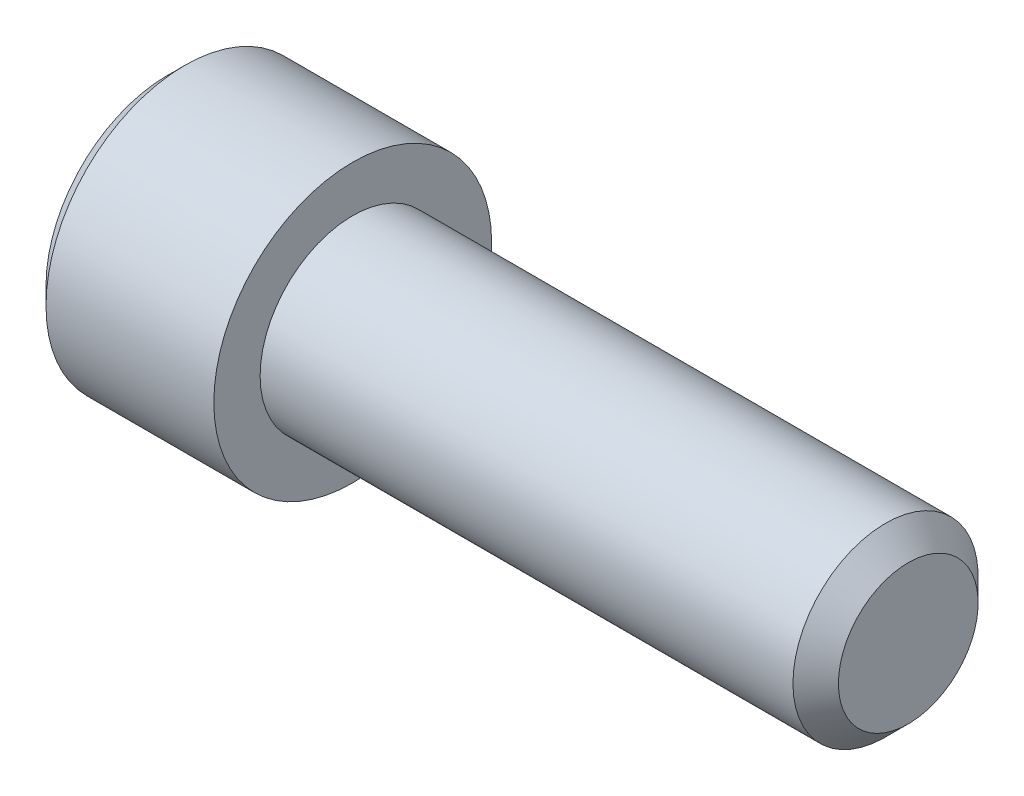
ISO-10303-21;
HEADER;
FILE_DESCRIPTION(('STEP AP214'),'2;1');
FILE_NAME('part.step','',(''),(''),'','','');
FILE_SCHEMA(('AUTOMOTIVE_DESIGN { 1 0 10303 214 1 1 1 1 }'));
ENDSEC;
DATA;
#1=APPLICATION_CONTEXT('core data for automotive mechanical design processes');
#2=APPLICATION_PROTOCOL_DEFINITION('international standard','automotive_design',2000,#1);
#3=PRODUCT_CONTEXT('',#1,'mechanical');
#4=PRODUCT('Part','Part','',(#3));
#5=PRODUCT_RELATED_PRODUCT_CATEGORY('part','',(#4));
#6=PRODUCT_DEFINITION_FORMATION('','',#4);
#7=PRODUCT_DEFINITION_CONTEXT('part definition',#1,'design');
#8=PRODUCT_DEFINITION('design','',#6,#7);
#9=PRODUCT_DEFINITION_SHAPE('','',#8);
#10=(LENGTH_UNIT() NAMED_UNIT(*) SI_UNIT(.MILLI.,.METRE.));
#11=(NAMED_UNIT(*) PLANE_ANGLE_UNIT() SI_UNIT($,.RADIAN.));
#12=(NAMED_UNIT(*) SI_UNIT($,.STERADIAN.) SOLID_ANGLE_UNIT());
#13=UNCERTAINTY_MEASURE_WITH_UNIT(LENGTH_MEASURE(1.E-05),#10,'distance_accuracy_value','');
#14=(GEOMETRIC_REPRESENTATION_CONTEXT(3) GLOBAL_UNCERTAINTY_ASSIGNED_CONTEXT((#13)) GLOBAL_UNIT_ASSIGNED_CONTEXT((#10,
#11,#12)) REPRESENTATION_CONTEXT('',''));
#15=CARTESIAN_POINT('',(0.,0.,0.));
#16=DIRECTION('',(0.,0.,1.));
#17=DIRECTION('',(1.,0.,0.));
#18=AXIS2_PLACEMENT_3D('',#15,#16,#17);
#19=CARTESIAN_POINT('',(-1.85,0.,0.));
#20=DIRECTION('',(-1.,0.,0.));
#21=DIRECTION('',(0.,0.,1.));
#22=AXIS2_PLACEMENT_3D('',#19,#20,#21);
#23=CONICAL_SURFACE('',#22,0.75,0.785398163397448);
#24=CARTESIAN_POINT('',(-2.,0.,0.));
#25=DIRECTION('',(-1.,0.,0.));
#26=DIRECTION('',(0.,0.,1.));
#27=AXIS2_PLACEMENT_3D('',#24,#25,#26);
#28=CIRCLE('',#27,0.9);
#29=CARTESIAN_POINT('',(-2.,0.,0.9));
#30=VERTEX_POINT('',#29);
#31=EDGE_CURVE('E226',#30,#30,#28,.T.);
#32=ORIENTED_EDGE('',*,*,#31,.T.);
#33=EDGE_LOOP('',(#32));
#34=FACE_BOUND('',#33,.T.);
#35=CARTESIAN_POINT('',(-1.96614089692921,0.866140873838278,-0.0002));
#36=CARTESIAN_POINT('',(-1.95125951424836,0.85125103201321,0.0255899625576815));
#37=CARTESIAN_POINT('',(-1.9372516693914,0.83611219228842,0.0518112021286592));
#38=CARTESIAN_POINT('',(-1.9116029284667,0.80524213589435,0.105279708235706));
#39=CARTESIAN_POINT('',(-1.89997631549011,0.789507978959821,0.132532067460573));
#40=CARTESIAN_POINT('',(-1.88005944955668,0.757780686272654,0.187485350381353));
#41=CARTESIAN_POINT('',(-1.87171909786581,0.741795643459148,0.21517225669551));
#42=CARTESIAN_POINT('',(-1.85886814574587,0.709473647943368,0.271155595130853));
#43=CARTESIAN_POINT('',(-1.85434794437328,0.693137683900543,0.299450314843645));
#44=CARTESIAN_POINT('',(-1.85027123688187,0.664986099540475,0.348210289268844));
#45=CARTESIAN_POINT('',(-1.84966820039852,0.653207128451651,0.368612065655573));
#46=CARTESIAN_POINT('',(-1.85067990979997,0.629671982217687,0.40937613469636));
#47=CARTESIAN_POINT('',(-1.85229514477447,0.617915812672248,0.429738417651455));
#48=CARTESIAN_POINT('',(-1.86036155075748,0.582815153286452,0.490534543086824));
#49=CARTESIAN_POINT('',(-1.87003433961216,0.559645329552699,0.530665854996099));
#50=CARTESIAN_POINT('',(-1.89338172175675,0.518974152327359,0.601110400354026));
#51=CARTESIAN_POINT('',(-1.90583396185669,0.501282308923486,0.631753572009086));
#52=CARTESIAN_POINT('',(-1.9338850140153,0.466591771248069,0.69183934580479));
#53=CARTESIAN_POINT('',(-1.94947358968819,0.449591032904757,0.721285488381591));
#54=CARTESIAN_POINT('',(-1.96614089692921,0.432897231838382,0.7502));
#55=B_SPLINE_CURVE_WITH_KNOTS('',3,(#35,#36,#37,#38,#39,#40,#41,#42,#43,#44,#45,#46,#47,#48,#49,
#50,#51,#52,#53,#54),.UNSPECIFIED.,.F.,.F.,(4,2,2,2,2,2,2,2,2,4),(0.,0.0999419466095598,
0.200466857654446,0.299393763705718,0.398071297300231,0.468665775681748,0.53927582139884,
0.680536257244566,0.792918418368074,0.904939568716032),.UNSPECIFIED.);
#56=CARTESIAN_POINT('',(-1.96602540378444,0.86602540378444,0.));
#57=VERTEX_POINT('',#56);
#58=CARTESIAN_POINT('',(-1.96602540378444,0.43301270189222,0.75));
#59=VERTEX_POINT('',#58);
#60=EDGE_CURVE('E54',#57,#59,#55,.T.);
#61=ORIENTED_EDGE('',*,*,#60,.T.);
#62=CARTESIAN_POINT('',(-2.28498450539523,-0.917435707843764,0.75));
#63=CARTESIAN_POINT('',(-2.2678667108574,-0.895322637488462,0.75));
#64=CARTESIAN_POINT('',(-2.25090072767686,-0.873092435797409,0.75));
#65=CARTESIAN_POINT('',(-2.21733662385259,-0.828348331249561,0.75));
#66=CARTESIAN_POINT('',(-2.20073858866413,-0.805834364354332,0.75));
#67=CARTESIAN_POINT('',(-2.15135585709605,-0.737463645985081,0.75));
#68=CARTESIAN_POINT('',(-2.11924462594972,-0.691112526673733,0.75));
#69=CARTESIAN_POINT('',(-2.05568682596992,-0.593551125551393,0.75));
#70=CARTESIAN_POINT('',(-2.02442165720724,-0.542221451270677,0.75));
#71=CARTESIAN_POINT('',(-1.96687568450647,-0.436934399168266,0.75));
#72=CARTESIAN_POINT('',(-1.94057804705966,-0.382986703868344,0.75));
#73=CARTESIAN_POINT('',(-1.90839074036174,-0.302507607984157,0.75));
#74=CARTESIAN_POINT('',(-1.89924982674428,-0.277284063785511,0.75));
#75=CARTESIAN_POINT('',(-1.88298812399052,-0.226180863902708,0.75));
#76=CARTESIAN_POINT('',(-1.87586746044888,-0.20030116753587,0.75));
#77=CARTESIAN_POINT('',(-1.86415365084109,-0.148504398457123,0.75));
#78=CARTESIAN_POINT('',(-1.85951333869583,-0.122598170477208,0.75));
#79=CARTESIAN_POINT('',(-1.85285693649874,-0.070440295072611,0.75));
#80=CARTESIAN_POINT('',(-1.85084110928875,-0.0441886133166744,0.75));
#81=CARTESIAN_POINT('',(-1.84961537614473,0.00715979592785976,0.75));
#82=CARTESIAN_POINT('',(-1.85027949049467,0.0322535332763837,0.75));
#83=CARTESIAN_POINT('',(-1.85408395670594,0.082242672718766,0.75));
#84=CARTESIAN_POINT('',(-1.85722369361662,0.107138122516666,0.75));
#85=CARTESIAN_POINT('',(-1.86585263917875,0.156986366361875,0.75));
#86=CARTESIAN_POINT('',(-1.87138423328569,0.181931702819942,0.75));
#87=CARTESIAN_POINT('',(-1.88448687025693,0.231269085182803,0.75));
#88=CARTESIAN_POINT('',(-1.89205781682589,0.255661157153014,0.75));
#89=CARTESIAN_POINT('',(-1.91810014054592,0.330191673605323,0.75));
#90=CARTESIAN_POINT('',(-1.93943977214851,0.379324631470661,0.75));
#91=CARTESIAN_POINT('',(-1.98693832469846,0.475298904003308,0.75));
#92=CARTESIAN_POINT('',(-2.01311412250561,0.522131443026563,0.75));
#93=CARTESIAN_POINT('',(-2.06717247921482,0.611659319459457,0.75));
#94=CARTESIAN_POINT('',(-2.09490758962535,0.654444829936083,0.75));
#95=CARTESIAN_POINT('',(-2.13780794830858,0.717480249811218,0.75));
#96=CARTESIAN_POINT('',(-2.15226421085697,0.738221190091019,0.75));
#97=CARTESIAN_POINT('',(-2.18156559351443,0.779418304292079,0.75));
#98=CARTESIAN_POINT('',(-2.19641060589534,0.799874554748216,0.75));
#99=CARTESIAN_POINT('',(-2.21141700400184,0.820212019409876,0.75));
#100=B_SPLINE_CURVE_WITH_KNOTS('',3,(#62,#63,#64,#65,#66,#67,#68,#69,#70,#71,#72,#73,#74,#75,
#76,#77,#78,#79,#80,#81,#82,#83,#84,#85,#86,#87,#88,#89,#90,#91,#92,#93,#94,#95,#96,#97,#98,
#99),.UNSPECIFIED.,.F.,.F.,(4,2,2,2,2,2,2,2,2,2,2,2,2,2,2,2,2,2,4),(0.,0.083891166922223,
0.167801617506669,0.336896584417538,0.517070724437731,0.696622901565622,0.77704232374542,
0.857466744334747,0.936301883451218,1.01514491728988,1.09032587205516,1.16548815756962,
1.24204077046884,1.31858976929581,1.47882432997554,1.63962900434597,1.79251782144892,
1.86836026980847,1.94418191901598),.UNSPECIFIED.);
#101=CARTESIAN_POINT('',(-1.96602540378444,-0.43301270189222,0.75));
#102=VERTEX_POINT('',#101);
#103=EDGE_CURVE('E196',#59,#102,#100,.F.);
#104=ORIENTED_EDGE('',*,*,#103,.T.);
#105=CARTESIAN_POINT('',(-1.96614089692921,-0.432897231838382,0.7502));
#106=CARTESIAN_POINT('',(-1.95125951424836,-0.44778707366345,0.724410037442319));
#107=CARTESIAN_POINT('',(-1.9372516693914,-0.462925913388239,0.698188797871341));
#108=CARTESIAN_POINT('',(-1.9116029284667,-0.49379596978231,0.644720291764294));
#109=CARTESIAN_POINT('',(-1.89997631549011,-0.509530126716839,0.617467932539428));
#110=CARTESIAN_POINT('',(-1.88005944955668,-0.541257419404005,0.562514649618648));
#111=CARTESIAN_POINT('',(-1.87171909786581,-0.557242462217511,0.534827743304491));
#112=CARTESIAN_POINT('',(-1.85886814574587,-0.589564457733291,0.478844404869148));
#113=CARTESIAN_POINT('',(-1.85434794437328,-0.605900421776116,0.450549685156356));
#114=CARTESIAN_POINT('',(-1.85027123688187,-0.634052006136184,0.401789710731158));
#115=CARTESIAN_POINT('',(-1.84966820039852,-0.645830977225008,0.381387934344429));
#116=CARTESIAN_POINT('',(-1.85067990979997,-0.669366123458972,0.340623865303642));
#117=CARTESIAN_POINT('',(-1.85229514477447,-0.681122293004411,0.320261582348547));
#118=CARTESIAN_POINT('',(-1.86036155075748,-0.716222952390207,0.259465456913178));
#119=CARTESIAN_POINT('',(-1.87003433961216,-0.73939277612396,0.219334145003903));
#120=CARTESIAN_POINT('',(-1.89338172175675,-0.7800639533493,0.148889599645976));
#121=CARTESIAN_POINT('',(-1.90583396185669,-0.797755796753174,0.118246427990915));
#122=CARTESIAN_POINT('',(-1.9338850140153,-0.83244633442859,0.0581606541952108));
#123=CARTESIAN_POINT('',(-1.94947358968819,-0.849447072771903,0.0287145116184096));
#124=CARTESIAN_POINT('',(-1.96614089692921,-0.866140873838278,-0.000199999999999989));
#125=B_SPLINE_CURVE_WITH_KNOTS('',3,(#105,#106,#107,#108,#109,#110,#111,#112,#113,#114,#115,
#116,#117,#118,#119,#120,#121,#122,#123,#124),.UNSPECIFIED.,.F.,.F.,(4,2,2,2,2,2,2,2,2,4),(0.,
0.0999419466095593,0.200466857654446,0.299393763705716,0.398071297300229,0.468665775681746,
0.539275821398837,0.680536257244564,0.792918418368073,0.904939568716032),.UNSPECIFIED.);
#126=CARTESIAN_POINT('',(-1.96602540378444,-0.86602540378444,0.));
#127=VERTEX_POINT('',#126);
#128=EDGE_CURVE('E140',#102,#127,#125,.T.);
#129=ORIENTED_EDGE('',*,*,#128,.T.);
#130=CARTESIAN_POINT('',(-1.96614089692921,-0.866140873838278,0.0002));
#131=CARTESIAN_POINT('',(-1.95125951424836,-0.85125103201321,-0.0255899625576815));
#132=CARTESIAN_POINT('',(-1.9372516693914,-0.83611219228842,-0.0518112021286592));
#133=CARTESIAN_POINT('',(-1.9116029284667,-0.80524213589435,-0.105279708235706));
#134=CARTESIAN_POINT('',(-1.89997631549011,-0.789507978959821,-0.132532067460573));
#135=CARTESIAN_POINT('',(-1.88005944955668,-0.757780686272654,-0.187485350381353));
#136=CARTESIAN_POINT('',(-1.87171909786581,-0.741795643459148,-0.21517225669551));
#137=CARTESIAN_POINT('',(-1.85886814574587,-0.709473647943368,-0.271155595130853));
#138=CARTESIAN_POINT('',(-1.85434794437328,-0.693137683900543,-0.299450314843645));
#139=CARTESIAN_POINT('',(-1.85027123688187,-0.664986099540475,-0.348210289268844));
#140=CARTESIAN_POINT('',(-1.84966820039852,-0.653207128451651,-0.368612065655573));
#141=CARTESIAN_POINT('',(-1.85067990979997,-0.629671982217687,-0.40937613469636));
#142=CARTESIAN_POINT('',(-1.85229514477447,-0.617915812672248,-0.429738417651455));
#143=CARTESIAN_POINT('',(-1.86036155075748,-0.582815153286452,-0.490534543086824));
#144=CARTESIAN_POINT('',(-1.87003433961216,-0.559645329552699,-0.530665854996099));
#145=CARTESIAN_POINT('',(-1.89338172175675,-0.518974152327359,-0.601110400354026));
#146=CARTESIAN_POINT('',(-1.90583396185669,-0.501282308923486,-0.631753572009086));
#147=CARTESIAN_POINT('',(-1.9338850140153,-0.466591771248069,-0.69183934580479));
#148=CARTESIAN_POINT('',(-1.94947358968819,-0.449591032904757,-0.721285488381591));
#149=CARTESIAN_POINT('',(-1.96614089692921,-0.432897231838382,-0.7502));
#150=B_SPLINE_CURVE_WITH_KNOTS('',3,(#130,#131,#132,#133,#134,#135,#136,#137,#138,#139,#140,
#141,#142,#143,#144,#145,#146,#147,#148,#149),.UNSPECIFIED.,.F.,.F.,(4,2,2,2,2,2,2,2,2,4),(0.,
0.0999419466095598,0.200466857654446,0.299393763705718,0.398071297300231,0.468665775681748,
0.53927582139884,0.680536257244566,0.792918418368074,0.904939568716032),.UNSPECIFIED.);
#151=CARTESIAN_POINT('',(-1.96602540378444,-0.43301270189222,-0.75));
#152=VERTEX_POINT('',#151);
#153=EDGE_CURVE('E187',#127,#152,#150,.T.);
#154=ORIENTED_EDGE('',*,*,#153,.T.);
#155=CARTESIAN_POINT('',(-2.28498450539523,-0.917435707843764,-0.75));
#156=CARTESIAN_POINT('',(-2.2678667108574,-0.895322637488462,-0.75));
#157=CARTESIAN_POINT('',(-2.25090072767686,-0.873092435797409,-0.75));
#158=CARTESIAN_POINT('',(-2.21733662385259,-0.828348331249561,-0.75));
#159=CARTESIAN_POINT('',(-2.20073858866413,-0.805834364354332,-0.75));
#160=CARTESIAN_POINT('',(-2.15135585709605,-0.737463645985081,-0.75));
#161=CARTESIAN_POINT('',(-2.11924462594972,-0.691112526673733,-0.75));
#162=CARTESIAN_POINT('',(-2.05568682596992,-0.593551125551393,-0.75));
#163=CARTESIAN_POINT('',(-2.02442165720724,-0.542221451270677,-0.75));
#164=CARTESIAN_POINT('',(-1.96687568450647,-0.436934399168266,-0.75));
#165=CARTESIAN_POINT('',(-1.94057804705966,-0.382986703868344,-0.75));
#166=CARTESIAN_POINT('',(-1.90839074036174,-0.302507607984157,-0.75));
#167=CARTESIAN_POINT('',(-1.89924982674428,-0.277284063785511,-0.75));
#168=CARTESIAN_POINT('',(-1.88298812399052,-0.226180863902708,-0.75));
#169=CARTESIAN_POINT('',(-1.87586746044888,-0.20030116753587,-0.75));
#170=CARTESIAN_POINT('',(-1.86415365084109,-0.148504398457123,-0.75));
#171=CARTESIAN_POINT('',(-1.85951333869583,-0.122598170477208,-0.75));
#172=CARTESIAN_POINT('',(-1.85285693649874,-0.070440295072611,-0.75));
#173=CARTESIAN_POINT('',(-1.85084110928875,-0.0441886133166744,-0.75));
#174=CARTESIAN_POINT('',(-1.84961537614473,0.00715979592785976,-0.75));
#175=CARTESIAN_POINT('',(-1.85027949049467,0.0322535332763837,-0.75));
#176=CARTESIAN_POINT('',(-1.85408395670594,0.082242672718766,-0.75));
#177=CARTESIAN_POINT('',(-1.85722369361662,0.107138122516666,-0.75));
#178=CARTESIAN_POINT('',(-1.86585263917875,0.156986366361875,-0.75));
#179=CARTESIAN_POINT('',(-1.87138423328569,0.181931702819942,-0.75));
#180=CARTESIAN_POINT('',(-1.88448687025693,0.231269085182803,-0.75));
#181=CARTESIAN_POINT('',(-1.89205781682589,0.255661157153014,-0.75));
#182=CARTESIAN_POINT('',(-1.91810014054592,0.330191673605323,-0.75));
#183=CARTESIAN_POINT('',(-1.93943977214851,0.379324631470661,-0.75));
#184=CARTESIAN_POINT('',(-1.98693832469846,0.475298904003308,-0.75));
#185=CARTESIAN_POINT('',(-2.01311412250561,0.522131443026563,-0.75));
#186=CARTESIAN_POINT('',(-2.06717247921482,0.611659319459457,-0.75));
#187=CARTESIAN_POINT('',(-2.09490758962535,0.654444829936083,-0.75));
#188=CARTESIAN_POINT('',(-2.13780794830858,0.717480249811218,-0.75));
#189=CARTESIAN_POINT('',(-2.15226421085697,0.738221190091019,-0.75));
#190=CARTESIAN_POINT('',(-2.18156559351443,0.779418304292079,-0.75));
#191=CARTESIAN_POINT('',(-2.19641060589534,0.799874554748216,-0.75));
#192=CARTESIAN_POINT('',(-2.21141700400184,0.820212019409876,-0.75));
#193=B_SPLINE_CURVE_WITH_KNOTS('',3,(#155,#156,#157,#158,#159,#160,#161,#162,#163,#164,#165,
#166,#167,#168,#169,#170,#171,#172,#173,#174,#175,#176,#177,#178,#179,#180,#181,#182,#183,#184,
#185,#186,#187,#188,#189,#190,#191,#192),.UNSPECIFIED.,.F.,.F.,(4,2,2,2,2,2,2,2,2,2,2,2,2,2,2,2,
2,2,4),(0.,0.083891166922223,0.167801617506669,0.336896584417538,0.517070724437731,
0.696622901565622,0.77704232374542,0.857466744334747,0.936301883451218,1.01514491728988,
1.09032587205516,1.16548815756962,1.24204077046884,1.31858976929581,1.47882432997554,
1.63962900434597,1.79251782144892,1.86836026980847,1.94418191901598),.UNSPECIFIED.);
#194=CARTESIAN_POINT('',(-1.96602540378444,0.43301270189222,-0.75));
#195=VERTEX_POINT('',#194);
#196=EDGE_CURVE('E182',#152,#195,#193,.T.);
#197=ORIENTED_EDGE('',*,*,#196,.T.);
#198=CARTESIAN_POINT('',(-1.96614089692921,0.432897231838382,-0.7502));
#199=CARTESIAN_POINT('',(-1.95125951424836,0.44778707366345,-0.724410037442319));
#200=CARTESIAN_POINT('',(-1.9372516693914,0.462925913388239,-0.698188797871341));
#201=CARTESIAN_POINT('',(-1.9116029284667,0.49379596978231,-0.644720291764294));
#202=CARTESIAN_POINT('',(-1.89997631549011,0.509530126716839,-0.617467932539428));
#203=CARTESIAN_POINT('',(-1.88005944955668,0.541257419404005,-0.562514649618648));
#204=CARTESIAN_POINT('',(-1.87171909786581,0.557242462217511,-0.534827743304491));
#205=CARTESIAN_POINT('',(-1.85886814574587,0.589564457733291,-0.478844404869148));
#206=CARTESIAN_POINT('',(-1.85434794437328,0.605900421776116,-0.450549685156356));
#207=CARTESIAN_POINT('',(-1.85027123688187,0.634052006136184,-0.401789710731158));
#208=CARTESIAN_POINT('',(-1.84966820039852,0.645830977225008,-0.381387934344429));
#209=CARTESIAN_POINT('',(-1.85067990979997,0.669366123458972,-0.340623865303642));
#210=CARTESIAN_POINT('',(-1.85229514477447,0.681122293004411,-0.320261582348547));
#211=CARTESIAN_POINT('',(-1.86036155075748,0.716222952390207,-0.259465456913178));
#212=CARTESIAN_POINT('',(-1.87003433961216,0.73939277612396,-0.219334145003903));
#213=CARTESIAN_POINT('',(-1.89338172175675,0.7800639533493,-0.148889599645976));
#214=CARTESIAN_POINT('',(-1.90583396185669,0.797755796753174,-0.118246427990915));
#215=CARTESIAN_POINT('',(-1.9338850140153,0.83244633442859,-0.0581606541952108));
#216=CARTESIAN_POINT('',(-1.94947358968819,0.849447072771903,-0.0287145116184096));
#217=CARTESIAN_POINT('',(-1.96614089692921,0.866140873838278,0.000199999999999989));
#218=B_SPLINE_CURVE_WITH_KNOTS('',3,(#198,#199,#200,#201,#202,#203,#204,#205,#206,#207,#208,
#209,#210,#211,#212,#213,#214,#215,#216,#217),.UNSPECIFIED.,.F.,.F.,(4,2,2,2,2,2,2,2,2,4),(0.,
0.0999419466095593,0.200466857654446,0.299393763705716,0.398071297300229,0.468665775681746,
0.539275821398837,0.680536257244564,0.792918418368073,0.904939568716032),.UNSPECIFIED.);
#219=EDGE_CURVE('E143',#195,#57,#218,.T.);
#220=ORIENTED_EDGE('',*,*,#219,.T.);
#221=EDGE_LOOP('',(#61,#104,#129,#154,#197,#220));
#222=FACE_BOUND('',#221,.T.);
#223=ADVANCED_FACE('F39',(#34,#222),#23,.F.);
#224=CARTESIAN_POINT('',(-2.,0.,0.));
#225=DIRECTION('',(1.,0.,0.));
#226=DIRECTION('',(0.,0.,-1.));
#227=AXIS2_PLACEMENT_3D('',#224,#225,#226);
#228=PLANE('',#227);
#229=CARTESIAN_POINT('',(-2.,0.,0.));
#230=DIRECTION('',(-1.,0.,0.));
#231=DIRECTION('',(0.,0.,1.));
#232=AXIS2_PLACEMENT_3D('',#229,#230,#231);
#233=CIRCLE('',#232,1.3125);
#234=CARTESIAN_POINT('',(-2.,0.,1.3125));
#235=VERTEX_POINT('',#234);
#236=EDGE_CURVE('E11',#235,#235,#233,.T.);
#237=ORIENTED_EDGE('',*,*,#236,.T.);
#238=EDGE_LOOP('',(#237));
#239=FACE_BOUND('',#238,.T.);
#240=ORIENTED_EDGE('',*,*,#31,.F.);
#241=EDGE_LOOP('',(#240));
#242=FACE_BOUND('',#241,.T.);
#243=ADVANCED_FACE('F41',(#239,#242),#228,.F.);
#244=CARTESIAN_POINT('',(-1.8125,0.,0.));
#245=DIRECTION('',(1.,0.,0.));
#246=DIRECTION('',(0.,0.,-1.));
#247=AXIS2_PLACEMENT_3D('',#244,#245,#246);
#248=CONICAL_SURFACE('',#247,1.5,0.785398163397448);
#249=ORIENTED_EDGE('',*,*,#236,.F.);
#250=EDGE_LOOP('',(#249));
#251=FACE_BOUND('',#250,.T.);
#252=CARTESIAN_POINT('',(-1.8125,0.,0.));
#253=DIRECTION('',(-1.,0.,0.));
#254=DIRECTION('',(0.,0.,1.));
#255=AXIS2_PLACEMENT_3D('',#252,#253,#254);
#256=CIRCLE('',#255,1.5);
#257=CARTESIAN_POINT('',(-1.8125,0.,1.5));
#258=VERTEX_POINT('',#257);
#259=EDGE_CURVE('E47',#258,#258,#256,.T.);
#260=ORIENTED_EDGE('',*,*,#259,.T.);
#261=EDGE_LOOP('',(#260));
#262=FACE_BOUND('',#261,.T.);
#263=ADVANCED_FACE('F222',(#251,#262),#248,.T.);
#264=CARTESIAN_POINT('',(6.,0.,0.));
#265=DIRECTION('',(-1.,0.,0.));
#266=DIRECTION('',(0.,0.,1.));
#267=AXIS2_PLACEMENT_3D('',#264,#265,#266);
#268=CYLINDRICAL_SURFACE('',#267,1.5);
#269=ORIENTED_EDGE('',*,*,#259,.F.);
#270=EDGE_LOOP('',(#269));
#271=FACE_BOUND('',#270,.T.);
#272=CARTESIAN_POINT('',(0.,0.,0.));
#273=DIRECTION('',(-1.,0.,0.));
#274=DIRECTION('',(0.,0.,1.));
#275=AXIS2_PLACEMENT_3D('',#272,#273,#274);
#276=CIRCLE('',#275,1.5);
#277=CARTESIAN_POINT('',(0.,0.,1.5));
#278=VERTEX_POINT('',#277);
#279=EDGE_CURVE('E241',#278,#278,#276,.T.);
#280=ORIENTED_EDGE('',*,*,#279,.T.);
#281=EDGE_LOOP('',(#280));
#282=FACE_BOUND('',#281,.T.);
#283=ADVANCED_FACE('F247',(#271,#282),#268,.T.);
#284=CARTESIAN_POINT('',(0.,1.5,0.));
#285=DIRECTION('',(-1.,0.,0.));
#286=DIRECTION('',(0.,0.,1.));
#287=AXIS2_PLACEMENT_3D('',#284,#285,#286);
#288=PLANE('',#287);
#289=ORIENTED_EDGE('',*,*,#279,.F.);
#290=EDGE_LOOP('',(#289));
#291=FACE_BOUND('',#290,.T.);
#292=CARTESIAN_POINT('',(0.,0.,0.));
#293=DIRECTION('',(-1.,0.,0.));
#294=DIRECTION('',(0.,0.,1.));
#295=AXIS2_PLACEMENT_3D('',#292,#293,#294);
#296=CIRCLE('',#295,1.);
#297=CARTESIAN_POINT('',(0.,0.,1.));
#298=VERTEX_POINT('',#297);
#299=EDGE_CURVE('E238',#298,#298,#296,.T.);
#300=ORIENTED_EDGE('',*,*,#299,.T.);
#301=EDGE_LOOP('',(#300));
#302=FACE_BOUND('',#301,.T.);
#303=ADVANCED_FACE('F250',(#291,#302),#288,.F.);
#304=CARTESIAN_POINT('',(6.,0.,0.));
#305=DIRECTION('',(-1.,0.,0.));
#306=DIRECTION('',(0.,0.,1.));
#307=AXIS2_PLACEMENT_3D('',#304,#305,#306);
#308=CYLINDRICAL_SURFACE('',#307,1.);
#309=ORIENTED_EDGE('',*,*,#299,.F.);
#310=EDGE_LOOP('',(#309));
#311=FACE_BOUND('',#310,.T.);
#312=CARTESIAN_POINT('',(5.7545,0.,0.));
#313=DIRECTION('',(-1.,0.,0.));
#314=DIRECTION('',(0.,0.,1.));
#315=AXIS2_PLACEMENT_3D('',#312,#313,#314);
#316=CIRCLE('',#315,1.);
#317=CARTESIAN_POINT('',(5.7545,0.,1.));
#318=VERTEX_POINT('',#317);
#319=EDGE_CURVE('E232',#318,#318,#316,.T.);
#320=ORIENTED_EDGE('',*,*,#319,.T.);
#321=EDGE_LOOP('',(#320));
#322=FACE_BOUND('',#321,.T.);
#323=ADVANCED_FACE('F256',(#311,#322),#308,.T.);
#324=CARTESIAN_POINT('',(6.,0.,0.));
#325=DIRECTION('',(-1.,0.,0.));
#326=DIRECTION('',(0.,0.,1.));
#327=AXIS2_PLACEMENT_3D('',#324,#325,#326);
#328=CONICAL_SURFACE('',#327,0.7545,0.785398163397448);
#329=ORIENTED_EDGE('',*,*,#319,.F.);
#330=EDGE_LOOP('',(#329));
#331=FACE_BOUND('',#330,.T.);
#332=CARTESIAN_POINT('',(6.,0.,0.));
#333=DIRECTION('',(-1.,0.,0.));
#334=DIRECTION('',(0.,0.,1.));
#335=AXIS2_PLACEMENT_3D('',#332,#333,#334);
#336=CIRCLE('',#335,0.7545);
#337=CARTESIAN_POINT('',(6.,0.,0.7545));
#338=VERTEX_POINT('',#337);
#339=EDGE_CURVE('E228',#338,#338,#336,.T.);
#340=ORIENTED_EDGE('',*,*,#339,.T.);
#341=EDGE_LOOP('',(#340));
#342=FACE_BOUND('',#341,.T.);
#343=ADVANCED_FACE('F262',(#331,#342),#328,.T.);
#344=CARTESIAN_POINT('',(6.,0.7545,0.));
#345=DIRECTION('',(-1.,0.,0.));
#346=DIRECTION('',(0.,0.,1.));
#347=AXIS2_PLACEMENT_3D('',#344,#345,#346);
#348=PLANE('',#347);
#349=ORIENTED_EDGE('',*,*,#339,.F.);
#350=EDGE_LOOP('',(#349));
#351=FACE_BOUND('',#350,.T.);
#352=ADVANCED_FACE('F206',(#351),#348,.F.);
#353=CARTESIAN_POINT('',(-1.,0.43301270189222,0.75));
#354=DIRECTION('',(0.,0.,-1.));
#355=DIRECTION('',(-1.,0.,0.));
#356=AXIS2_PLACEMENT_3D('',#353,#354,#355);
#357=PLANE('',#356);
#358=DIRECTION('',(-1.,0.,0.));
#359=VECTOR('',#358,1.);
#360=CARTESIAN_POINT('',(-1.,0.43301270189222,0.75));
#361=LINE('',#360,#359);
#362=CARTESIAN_POINT('',(-1.,0.43301270189222,0.75));
#363=VERTEX_POINT('',#362);
#364=EDGE_CURVE('E426',#363,#59,#361,.T.);
#365=ORIENTED_EDGE('',*,*,#364,.F.);
#366=DIRECTION('',(0.,-1.,0.));
#367=VECTOR('',#366,1.);
#368=CARTESIAN_POINT('',(-1.,0.43301270189222,0.75));
#369=LINE('',#368,#367);
#370=CARTESIAN_POINT('',(-1.,0.,0.75));
#371=VERTEX_POINT('',#370);
#372=EDGE_CURVE('E123',#363,#371,#369,.T.);
#373=ORIENTED_EDGE('',*,*,#372,.T.);
#374=CARTESIAN_POINT('',(-1.,-0.43301270189222,0.75));
#375=VERTEX_POINT('',#374);
#376=EDGE_CURVE('E115',#371,#375,#369,.T.);
#377=ORIENTED_EDGE('',*,*,#376,.T.);
#378=DIRECTION('',(-1.,0.,0.));
#379=VECTOR('',#378,1.);
#380=CARTESIAN_POINT('',(-1.,-0.43301270189222,0.75));
#381=LINE('',#380,#379);
#382=EDGE_CURVE('E121',#375,#102,#381,.T.);
#383=ORIENTED_EDGE('',*,*,#382,.T.);
#384=ORIENTED_EDGE('',*,*,#103,.F.);
#385=EDGE_LOOP('',(#365,#373,#377,#383,#384));
#386=FACE_BOUND('',#385,.T.);
#387=ADVANCED_FACE('F118',(#386),#357,.T.);
#388=CARTESIAN_POINT('',(-1.,-0.43301270189222,0.75));
#389=DIRECTION('',(0.,0.866025403784438,-0.500000000000001));
#390=DIRECTION('',(0.,0.500000000000001,0.866025403784438));
#391=AXIS2_PLACEMENT_3D('',#388,#389,#390);
#392=PLANE('',#391);
#393=ORIENTED_EDGE('',*,*,#382,.F.);
#394=DIRECTION('',(0.,-0.500000000000001,-0.866025403784438));
#395=VECTOR('',#394,1.);
#396=CARTESIAN_POINT('',(-1.,-0.43301270189222,0.75));
#397=LINE('',#396,#395);
#398=CARTESIAN_POINT('',(-1.,-0.64951905283833,0.375000000000001));
#399=VERTEX_POINT('',#398);
#400=EDGE_CURVE('E128',#375,#399,#397,.T.);
#401=ORIENTED_EDGE('',*,*,#400,.T.);
#402=CARTESIAN_POINT('',(-1.,-0.86602540378444,0.));
#403=VERTEX_POINT('',#402);
#404=EDGE_CURVE('E135',#399,#403,#397,.T.);
#405=ORIENTED_EDGE('',*,*,#404,.T.);
#406=DIRECTION('',(-1.,0.,0.));
#407=VECTOR('',#406,1.);
#408=CARTESIAN_POINT('',(-1.,-0.86602540378444,0.));
#409=LINE('',#408,#407);
#410=EDGE_CURVE('E141',#403,#127,#409,.T.);
#411=ORIENTED_EDGE('',*,*,#410,.T.);
#412=ORIENTED_EDGE('',*,*,#128,.F.);
#413=EDGE_LOOP('',(#393,#401,#405,#411,#412));
#414=FACE_BOUND('',#413,.T.);
#415=ADVANCED_FACE('F138',(#414),#392,.T.);
#416=CARTESIAN_POINT('',(-1.,-0.86602540378444,0.));
#417=DIRECTION('',(0.,0.866025403784438,0.500000000000001));
#418=DIRECTION('',(0.,-0.500000000000001,0.866025403784438));
#419=AXIS2_PLACEMENT_3D('',#416,#417,#418);
#420=PLANE('',#419);
#421=ORIENTED_EDGE('',*,*,#410,.F.);
#422=DIRECTION('',(0.,0.500000000000001,-0.866025403784438));
#423=VECTOR('',#422,1.);
#424=CARTESIAN_POINT('',(-1.,-0.86602540378444,0.));
#425=LINE('',#424,#423);
#426=CARTESIAN_POINT('',(-1.,-0.649519052838329,-0.375));
#427=VERTEX_POINT('',#426);
#428=EDGE_CURVE('E62',#403,#427,#425,.T.);
#429=ORIENTED_EDGE('',*,*,#428,.T.);
#430=CARTESIAN_POINT('',(-1.,-0.43301270189222,-0.75));
#431=VERTEX_POINT('',#430);
#432=EDGE_CURVE('E134',#427,#431,#425,.T.);
#433=ORIENTED_EDGE('',*,*,#432,.T.);
#434=DIRECTION('',(-1.,0.,0.));
#435=VECTOR('',#434,1.);
#436=CARTESIAN_POINT('',(-1.,-0.43301270189222,-0.75));
#437=LINE('',#436,#435);
#438=EDGE_CURVE('E145',#431,#152,#437,.T.);
#439=ORIENTED_EDGE('',*,*,#438,.T.);
#440=ORIENTED_EDGE('',*,*,#153,.F.);
#441=EDGE_LOOP('',(#421,#429,#433,#439,#440));
#442=FACE_BOUND('',#441,.T.);
#443=ADVANCED_FACE('F178',(#442),#420,.T.);
#444=CARTESIAN_POINT('',(-1.,-0.43301270189222,-0.75));
#445=DIRECTION('',(0.,0.,1.));
#446=DIRECTION('',(1.,0.,0.));
#447=AXIS2_PLACEMENT_3D('',#444,#445,#446);
#448=PLANE('',#447);
#449=ORIENTED_EDGE('',*,*,#438,.F.);
#450=DIRECTION('',(0.,1.,0.));
#451=VECTOR('',#450,1.);
#452=CARTESIAN_POINT('',(-1.,-0.43301270189222,-0.75));
#453=LINE('',#452,#451);
#454=CARTESIAN_POINT('',(-1.,0.,-0.75));
#455=VERTEX_POINT('',#454);
#456=EDGE_CURVE('E439',#431,#455,#453,.T.);
#457=ORIENTED_EDGE('',*,*,#456,.T.);
#458=CARTESIAN_POINT('',(-1.,0.43301270189222,-0.75));
#459=VERTEX_POINT('',#458);
#460=EDGE_CURVE('E440',#455,#459,#453,.T.);
#461=ORIENTED_EDGE('',*,*,#460,.T.);
#462=DIRECTION('',(-1.,0.,0.));
#463=VECTOR('',#462,1.);
#464=CARTESIAN_POINT('',(-1.,0.43301270189222,-0.75));
#465=LINE('',#464,#463);
#466=EDGE_CURVE('E432',#459,#195,#465,.T.);
#467=ORIENTED_EDGE('',*,*,#466,.T.);
#468=ORIENTED_EDGE('',*,*,#196,.F.);
#469=EDGE_LOOP('',(#449,#457,#461,#467,#468));
#470=FACE_BOUND('',#469,.T.);
#471=ADVANCED_FACE('F173',(#470),#448,.T.);
#472=CARTESIAN_POINT('',(-1.,0.43301270189222,-0.75));
#473=DIRECTION('',(0.,-0.866025403784438,0.500000000000001));
#474=DIRECTION('',(0.,-0.500000000000001,-0.866025403784438));
#475=AXIS2_PLACEMENT_3D('',#472,#473,#474);
#476=PLANE('',#475);
#477=ORIENTED_EDGE('',*,*,#466,.F.);
#478=DIRECTION('',(0.,0.500000000000001,0.866025403784438));
#479=VECTOR('',#478,1.);
#480=CARTESIAN_POINT('',(-1.,0.43301270189222,-0.75));
#481=LINE('',#480,#479);
#482=CARTESIAN_POINT('',(-1.,0.64951905283833,-0.375000000000001));
#483=VERTEX_POINT('',#482);
#484=EDGE_CURVE('E421',#459,#483,#481,.T.);
#485=ORIENTED_EDGE('',*,*,#484,.T.);
#486=CARTESIAN_POINT('',(-1.,0.86602540378444,0.));
#487=VERTEX_POINT('',#486);
#488=EDGE_CURVE('E418',#483,#487,#481,.T.);
#489=ORIENTED_EDGE('',*,*,#488,.T.);
#490=DIRECTION('',(-1.,0.,0.));
#491=VECTOR('',#490,1.);
#492=CARTESIAN_POINT('',(-1.,0.86602540378444,0.));
#493=LINE('',#492,#491);
#494=EDGE_CURVE('E425',#487,#57,#493,.T.);
#495=ORIENTED_EDGE('',*,*,#494,.T.);
#496=ORIENTED_EDGE('',*,*,#219,.F.);
#497=EDGE_LOOP('',(#477,#485,#489,#495,#496));
#498=FACE_BOUND('',#497,.T.);
#499=ADVANCED_FACE('F167',(#498),#476,.T.);
#500=CARTESIAN_POINT('',(-1.,0.86602540378444,0.));
#501=DIRECTION('',(0.,-0.866025403784438,-0.500000000000001));
#502=DIRECTION('',(0.,0.500000000000001,-0.866025403784438));
#503=AXIS2_PLACEMENT_3D('',#500,#501,#502);
#504=PLANE('',#503);
#505=ORIENTED_EDGE('',*,*,#494,.F.);
#506=DIRECTION('',(0.,-0.500000000000001,0.866025403784438));
#507=VECTOR('',#506,1.);
#508=CARTESIAN_POINT('',(-1.,0.86602540378444,0.));
#509=LINE('',#508,#507);
#510=CARTESIAN_POINT('',(-1.,0.64951905283833,0.375000000000001));
#511=VERTEX_POINT('',#510);
#512=EDGE_CURVE('E417',#487,#511,#509,.T.);
#513=ORIENTED_EDGE('',*,*,#512,.T.);
#514=EDGE_CURVE('E420',#511,#363,#509,.T.);
#515=ORIENTED_EDGE('',*,*,#514,.T.);
#516=ORIENTED_EDGE('',*,*,#364,.T.);
#517=ORIENTED_EDGE('',*,*,#60,.F.);
#518=EDGE_LOOP('',(#505,#513,#515,#516,#517));
#519=FACE_BOUND('',#518,.T.);
#520=ADVANCED_FACE('F162',(#519),#504,.T.);
#521=CARTESIAN_POINT('',(-1.,0.,0.));
#522=DIRECTION('',(1.,0.,0.));
#523=DIRECTION('',(0.,0.,-1.));
#524=AXIS2_PLACEMENT_3D('',#521,#522,#523);
#525=PLANE('',#524);
#526=CARTESIAN_POINT('',(-1.,0.,0.));
#527=DIRECTION('',(-1.,0.,0.));
#528=DIRECTION('',(0.,0.,1.));
#529=AXIS2_PLACEMENT_3D('',#526,#527,#528);
#530=CIRCLE('',#529,0.75);
#531=EDGE_CURVE('E410',#483,#455,#530,.T.);
#532=ORIENTED_EDGE('',*,*,#531,.F.);
#533=ORIENTED_EDGE('',*,*,#484,.F.);
#534=ORIENTED_EDGE('',*,*,#460,.F.);
#535=EDGE_LOOP('',(#532,#533,#534));
#536=FACE_BOUND('',#535,.T.);
#537=ADVANCED_FACE('F166',(#536),#525,.F.);
#538=EDGE_CURVE('E234',#511,#483,#530,.T.);
#539=ORIENTED_EDGE('',*,*,#538,.F.);
#540=ORIENTED_EDGE('',*,*,#512,.F.);
#541=ORIENTED_EDGE('',*,*,#488,.F.);
#542=EDGE_LOOP('',(#539,#540,#541));
#543=FACE_BOUND('',#542,.T.);
#544=ADVANCED_FACE('F359',(#543),#525,.F.);
#545=EDGE_CURVE('E229',#371,#511,#530,.T.);
#546=ORIENTED_EDGE('',*,*,#545,.F.);
#547=ORIENTED_EDGE('',*,*,#372,.F.);
#548=ORIENTED_EDGE('',*,*,#514,.F.);
#549=EDGE_LOOP('',(#546,#547,#548));
#550=FACE_BOUND('',#549,.T.);
#551=ADVANCED_FACE('F368',(#550),#525,.F.);
#552=EDGE_CURVE('E130',#399,#371,#530,.T.);
#553=ORIENTED_EDGE('',*,*,#552,.F.);
#554=ORIENTED_EDGE('',*,*,#400,.F.);
#555=ORIENTED_EDGE('',*,*,#376,.F.);
#556=EDGE_LOOP('',(#553,#554,#555));
#557=FACE_BOUND('',#556,.T.);
#558=ADVANCED_FACE('F129',(#557),#525,.F.);
#559=EDGE_CURVE('E405',#427,#399,#530,.T.);
#560=ORIENTED_EDGE('',*,*,#559,.F.);
#561=ORIENTED_EDGE('',*,*,#428,.F.);
#562=ORIENTED_EDGE('',*,*,#404,.F.);
#563=EDGE_LOOP('',(#560,#561,#562));
#564=FACE_BOUND('',#563,.T.);
#565=ADVANCED_FACE('F213',(#564),#525,.F.);
#566=EDGE_CURVE('E407',#455,#427,#530,.T.);
#567=ORIENTED_EDGE('',*,*,#566,.F.);
#568=ORIENTED_EDGE('',*,*,#456,.F.);
#569=ORIENTED_EDGE('',*,*,#432,.F.);
#570=EDGE_LOOP('',(#567,#568,#569));
#571=FACE_BOUND('',#570,.T.);
#572=ADVANCED_FACE('F169',(#571),#525,.F.);
#573=CARTESIAN_POINT('',(-0.6,0.,0.));
#574=DIRECTION('',(-1.,0.,0.));
#575=DIRECTION('',(0.,0.,1.));
#576=AXIS2_PLACEMENT_3D('',#573,#574,#575);
#577=CONICAL_SURFACE('',#576,0.,1.08083900054117);
#578=ORIENTED_EDGE('',*,*,#545,.T.);
#579=ORIENTED_EDGE('',*,*,#538,.T.);
#580=ORIENTED_EDGE('',*,*,#531,.T.);
#581=ORIENTED_EDGE('',*,*,#566,.T.);
#582=ORIENTED_EDGE('',*,*,#559,.T.);
#583=ORIENTED_EDGE('',*,*,#552,.T.);
#584=EDGE_LOOP('',(#578,#579,#580,#581,#582,#583));
#585=FACE_BOUND('',#584,.T.);
#586=CARTESIAN_POINT('',(-0.6,0.,0.));
#587=VERTEX_POINT('',#586);
#588=VERTEX_LOOP('',#587);
#589=FACE_BOUND('',#588,.T.);
#590=ADVANCED_FACE('F207',(#585,#589),#577,.F.);
#591=CLOSED_SHELL('',(#223,#243,#263,#283,#303,#323,#343,#352,#387,#415,#443,#471,#499,#520,
#537,#544,#551,#558,#565,#572,#590));
#592=MANIFOLD_SOLID_BREP('B2',#591);
#593=ADVANCED_BREP_SHAPE_REPRESENTATION('',(#18,#592),#14);
#594=SHAPE_DEFINITION_REPRESENTATION(#9,#593);
ENDSEC;
END-ISO-10303-21;
